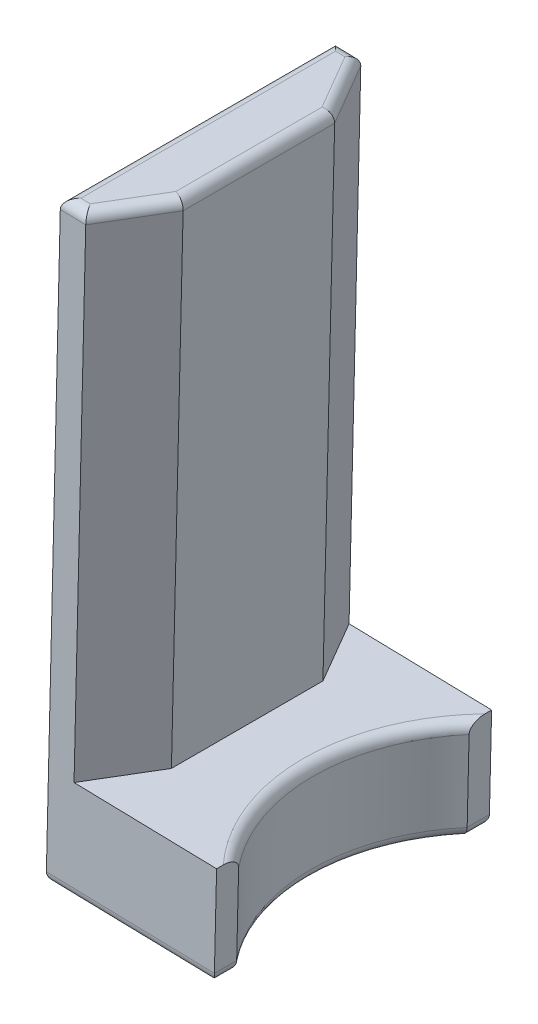
ISO-10303-21;
HEADER;
FILE_DESCRIPTION(('STEP AP214'),'2;1');
FILE_NAME('part.step','',(''),(''),'','','');
FILE_SCHEMA(('AUTOMOTIVE_DESIGN { 1 0 10303 214 1 1 1 1 }'));
ENDSEC;
DATA;
#1=APPLICATION_CONTEXT('core data for automotive mechanical design processes');
#2=APPLICATION_PROTOCOL_DEFINITION('international standard','automotive_design',2000,#1);
#3=PRODUCT_CONTEXT('',#1,'mechanical');
#4=PRODUCT('Part','Part','',(#3));
#5=PRODUCT_RELATED_PRODUCT_CATEGORY('part','',(#4));
#6=PRODUCT_DEFINITION_FORMATION('','',#4);
#7=PRODUCT_DEFINITION_CONTEXT('part definition',#1,'design');
#8=PRODUCT_DEFINITION('design','',#6,#7);
#9=PRODUCT_DEFINITION_SHAPE('','',#8);
#10=(LENGTH_UNIT() NAMED_UNIT(*) SI_UNIT(.MILLI.,.METRE.));
#11=(NAMED_UNIT(*) PLANE_ANGLE_UNIT() SI_UNIT($,.RADIAN.));
#12=(NAMED_UNIT(*) SI_UNIT($,.STERADIAN.) SOLID_ANGLE_UNIT());
#13=UNCERTAINTY_MEASURE_WITH_UNIT(LENGTH_MEASURE(1.E-05),#10,'distance_accuracy_value','');
#14=(GEOMETRIC_REPRESENTATION_CONTEXT(3) GLOBAL_UNCERTAINTY_ASSIGNED_CONTEXT((#13)) GLOBAL_UNIT_ASSIGNED_CONTEXT((#10,
#11,#12)) REPRESENTATION_CONTEXT('',''));
#15=CARTESIAN_POINT('',(0.,0.,0.));
#16=DIRECTION('',(0.,0.,1.));
#17=DIRECTION('',(1.,0.,0.));
#18=AXIS2_PLACEMENT_3D('',#15,#16,#17);
#19=CARTESIAN_POINT('',(312.212710503886,-7.48097473649797,-27.));
#20=DIRECTION('',(-0.999713055263902,0.0239542717466762,0.));
#21=DIRECTION('',(-0.0239542717466762,-0.999713055263902,0.));
#22=AXIS2_PLACEMENT_3D('',#19,#20,#21);
#23=PLANE('',#22);
#24=DIRECTION('',(-0.0239542717466767,-0.999713055263902,0.));
#25=VECTOR('',#24,1.);
#26=CARTESIAN_POINT('',(322.41968800889,418.499358727515,-22.6274169979697));
#27=LINE('',#26,#25);
#28=CARTESIAN_POINT('',(321.557334226009,382.509688738014,-22.6274169979697));
#29=VERTEX_POINT('',#28);
#30=CARTESIAN_POINT('',(321.174065878062,366.514279853791,-22.6274169979697));
#31=VERTEX_POINT('',#30);
#32=EDGE_CURVE('E206',#29,#31,#27,.T.);
#33=ORIENTED_EDGE('',*,*,#32,.T.);
#34=DIRECTION('',(0.,0.,1.));
#35=VECTOR('',#34,1.);
#36=CARTESIAN_POINT('',(321.174065878062,366.514279853791,-27.));
#37=LINE('',#36,#35);
#38=CARTESIAN_POINT('',(321.174065878062,366.514279853792,-27.));
#39=VERTEX_POINT('',#38);
#40=EDGE_CURVE('E194',#31,#39,#37,.F.);
#41=ORIENTED_EDGE('',*,*,#40,.T.);
#42=DIRECTION('',(-0.0239542717466762,-0.999713055263903,0.));
#43=VECTOR('',#42,1.);
#44=CARTESIAN_POINT('',(312.212710503886,-7.48097473649797,-27.));
#45=LINE('',#44,#43);
#46=CARTESIAN_POINT('',(321.605242769503,384.509114848542,-27.));
#47=VERTEX_POINT('',#46);
#48=EDGE_CURVE('E177',#47,#39,#45,.T.);
#49=ORIENTED_EDGE('',*,*,#48,.F.);
#50=DIRECTION('',(0.,0.,1.));
#51=VECTOR('',#50,1.);
#52=CARTESIAN_POINT('',(321.605242769503,384.509114848542,-27.));
#53=LINE('',#52,#51);
#54=CARTESIAN_POINT('',(321.605242769503,384.509114848542,-25.6904651573303));
#55=VERTEX_POINT('',#54);
#56=EDGE_CURVE('E185',#47,#55,#53,.T.);
#57=ORIENTED_EDGE('',*,*,#56,.T.);
#58=CARTESIAN_POINT('',(321.605242769503,384.509114848542,-25.6904651573303));
#59=CARTESIAN_POINT('',(321.605241949484,384.509080625702,-25.5681363487636));
#60=CARTESIAN_POINT('',(321.605119848522,384.503984836229,-25.4458070590447));
#61=CARTESIAN_POINT('',(321.604632711871,384.483654563825,-25.2018334432114));
#62=CARTESIAN_POINT('',(321.604267357184,384.468406767758,-25.0801902283216));
#63=CARTESIAN_POINT('',(321.603288130179,384.42753948401,-24.8373079758295));
#64=CARTESIAN_POINT('',(321.602671640287,384.401810753864,-24.7160871931749));
#65=CARTESIAN_POINT('',(321.601184144398,384.339731260228,-24.4764804771465));
#66=CARTESIAN_POINT('',(321.600313310594,384.303387683096,-24.358092684287));
#67=CARTESIAN_POINT('',(321.59799260216,384.206534706604,-24.089038378026));
#68=CARTESIAN_POINT('',(321.596446876627,384.1420250437,-23.9397805922497));
#69=CARTESIAN_POINT('',(321.592857408088,383.992221342814,-23.6524111430263));
#70=CARTESIAN_POINT('',(321.590815393284,383.906999429977,-23.514262968244));
#71=CARTESIAN_POINT('',(321.586895398504,383.743401471358,-23.2956911996913));
#72=CARTESIAN_POINT('',(321.585164462504,383.671162192501,-23.2106912152554));
#73=CARTESIAN_POINT('',(321.581416254245,383.514733611801,-23.0523514465289));
#74=CARTESIAN_POINT('',(321.5793993065,383.430557853364,-22.978998644326));
#75=CARTESIAN_POINT('',(321.575608188502,383.272338467838,-22.8648632672278));
#76=CARTESIAN_POINT('',(321.573896159977,383.20088827785,-22.8205065344314));
#77=CARTESIAN_POINT('',(321.570325455279,383.051867671368,-22.7439567540167));
#78=CARTESIAN_POINT('',(321.5684672262,382.974315914011,-22.7117282410686));
#79=CARTESIAN_POINT('',(321.565067927367,382.832448799127,-22.6675232461599));
#80=CARTESIAN_POINT('',(321.563548770456,382.769047957193,-22.6526306041589));
#81=CARTESIAN_POINT('',(321.56123883416,382.672644547517,-22.6375804674327));
#82=CARTESIAN_POINT('',(321.560461066946,382.640185032764,-22.6337782023778));
#83=CARTESIAN_POINT('',(321.558900372851,382.575050668465,-22.6286932532046));
#84=CARTESIAN_POINT('',(321.558117443213,382.542375703901,-22.6274120465554));
#85=CARTESIAN_POINT('',(321.557334226009,382.509688738014,-22.6274169979696));
#86=B_SPLINE_CURVE_WITH_KNOTS('',3,(#58,#59,#60,#61,#62,#63,#64,#65,#66,#67,#68,#69,#70,#71,#72,
#73,#74,#75,#76,#77,#78,#79,#80,#81,#82,#83,#84,#85),.UNSPECIFIED.,.F.,.F.,(4,2,2,2,2,2,2,2,2,2,
2,2,2,4),(0.,0.366883681164066,0.734249436281864,1.10554641039437,1.47659259314708,
1.96300563910557,2.44774855162823,2.78149425065146,3.1148642597889,3.36631097381268,
3.61701658608089,3.81170159100011,3.9096853731242,4.00772656166985),.UNSPECIFIED.);
#87=EDGE_CURVE('E270',#55,#29,#86,.T.);
#88=ORIENTED_EDGE('',*,*,#87,.T.);
#89=EDGE_LOOP('',(#33,#41,#49,#57,#88));
#90=FACE_BOUND('',#89,.T.);
#91=ADVANCED_FACE('F49',(#90),#23,.F.);
#92=CARTESIAN_POINT('',(291.218736343345,-6.97793502981761,-27.));
#93=DIRECTION('',(-0.999713055263903,0.0239542717466757,0.));
#94=DIRECTION('',(-0.0239542717466757,-0.999713055263903,0.));
#95=AXIS2_PLACEMENT_3D('',#92,#93,#94);
#96=PLANE('',#95);
#97=DIRECTION('',(0.0239542717466757,0.999713055263903,0.));
#98=VECTOR('',#97,1.);
#99=CARTESIAN_POINT('',(291.218736343345,-6.97793502981761,-14.8756443470179));
#100=LINE('',#99,#98);
#101=CARTESIAN_POINT('',(300.611268608961,385.012154555222,-14.8756443470179));
#102=VERTEX_POINT('',#101);
#103=CARTESIAN_POINT('',(302.910878696641,480.984607860557,-14.8756443470179));
#104=VERTEX_POINT('',#103);
#105=EDGE_CURVE('E222',#102,#104,#100,.T.);
#106=ORIENTED_EDGE('',*,*,#105,.T.);
#107=DIRECTION('',(0.,0.,1.));
#108=VECTOR('',#107,1.);
#109=CARTESIAN_POINT('',(302.910878696641,480.984607860557,-27.));
#110=LINE('',#109,#108);
#111=CARTESIAN_POINT('',(302.910878696641,480.984607860557,14.8756443470179));
#112=VERTEX_POINT('',#111);
#113=EDGE_CURVE('E59',#104,#112,#110,.T.);
#114=ORIENTED_EDGE('',*,*,#113,.T.);
#115=DIRECTION('',(-0.0239542717466757,-0.999713055263903,0.));
#116=VECTOR('',#115,1.);
#117=CARTESIAN_POINT('',(300.611268608961,385.012154555222,14.8756443470179));
#118=LINE('',#117,#116);
#119=CARTESIAN_POINT('',(300.611268608961,385.012154555222,14.8756443470179));
#120=VERTEX_POINT('',#119);
#121=EDGE_CURVE('E212',#112,#120,#118,.T.);
#122=ORIENTED_EDGE('',*,*,#121,.T.);
#123=DIRECTION('',(0.,0.,1.));
#124=VECTOR('',#123,1.);
#125=CARTESIAN_POINT('',(300.611268608961,385.012154555222,-27.));
#126=LINE('',#125,#124);
#127=EDGE_CURVE('E190',#102,#120,#126,.T.);
#128=ORIENTED_EDGE('',*,*,#127,.F.);
#129=EDGE_LOOP('',(#106,#114,#122,#128));
#130=FACE_BOUND('',#129,.T.);
#131=ADVANCED_FACE('F370',(#130),#96,.F.);
#132=CARTESIAN_POINT('',(9.39253226561721,391.99008958504,-27.));
#133=DIRECTION('',(-0.0239542717466786,-0.999713055263902,0.));
#134=DIRECTION('',(0.999713055263903,-0.0239542717466787,0.));
#135=AXIS2_PLACEMENT_3D('',#132,#133,#134);
#136=PLANE('',#135);
#137=CARTESIAN_POINT('',(321.605242769503,384.509114848542,25.6904651573303));
#138=VERTEX_POINT('',#137);
#139=CARTESIAN_POINT('',(321.605242769503,384.509114848542,27.));
#140=VERTEX_POINT('',#139);
#141=EDGE_CURVE('E182',#138,#140,#53,.T.);
#142=ORIENTED_EDGE('',*,*,#141,.F.);
#143=CARTESIAN_POINT('',(349.597208316892,383.838395239635,0.));
#144=DIRECTION('',(-0.0239542717466786,-0.999713055263902,0.));
#145=DIRECTION('',(0.999713055263903,-0.0239542717466787,0.));
#146=AXIS2_PLACEMENT_3D('',#143,#144,#145);
#147=CIRCLE('',#146,38.);
#148=EDGE_CURVE('E13',#138,#55,#147,.T.);
#149=ORIENTED_EDGE('',*,*,#148,.T.);
#150=ORIENTED_EDGE('',*,*,#56,.F.);
#151=DIRECTION('',(0.999713055263902,-0.0239542717466787,0.));
#152=VECTOR('',#151,1.);
#153=CARTESIAN_POINT('',(9.39253226561721,391.99008958504,-27.));
#154=LINE('',#153,#152);
#155=CARTESIAN_POINT('',(293.613277222113,385.179834457449,-27.));
#156=VERTEX_POINT('',#155);
#157=EDGE_CURVE('E172',#156,#47,#154,.T.);
#158=ORIENTED_EDGE('',*,*,#157,.F.);
#159=DIRECTION('',(-0.49985652763195,0.0119771358733393,-0.866025403784439));
#160=VECTOR('',#159,1.);
#161=CARTESIAN_POINT('',(222.55809098299,386.882398239347,-150.1065174746));
#162=LINE('',#161,#160);
#163=EDGE_CURVE('E224',#156,#102,#162,.F.);
#164=ORIENTED_EDGE('',*,*,#163,.T.);
#165=ORIENTED_EDGE('',*,*,#127,.T.);
#166=DIRECTION('',(-0.49985652763195,0.0119771358733393,0.866025403784439));
#167=VECTOR('',#166,1.);
#168=CARTESIAN_POINT('',(245.934067346534,386.322283027079,109.6065174746));
#169=LINE('',#168,#167);
#170=CARTESIAN_POINT('',(293.613277222113,385.179834457449,27.));
#171=VERTEX_POINT('',#170);
#172=EDGE_CURVE('E218',#120,#171,#169,.T.);
#173=ORIENTED_EDGE('',*,*,#172,.T.);
#174=DIRECTION('',(0.999713055263902,-0.0239542717466787,0.));
#175=VECTOR('',#174,1.);
#176=CARTESIAN_POINT('',(9.39253226561721,391.99008958504,27.));
#177=LINE('',#176,#175);
#178=EDGE_CURVE('E198',#171,#140,#177,.T.);
#179=ORIENTED_EDGE('',*,*,#178,.T.);
#180=EDGE_LOOP('',(#142,#149,#150,#158,#164,#165,#173,#179));
#181=FACE_BOUND('',#180,.T.);
#182=ADVANCED_FACE('F187',(#181),#136,.F.);
#183=DIRECTION('',(-0.0239542717466762,-0.999713055263903,0.));
#184=VECTOR('',#183,1.);
#185=CARTESIAN_POINT('',(312.212710503886,-7.48097473649797,27.));
#186=LINE('',#185,#184);
#187=CARTESIAN_POINT('',(321.174065878062,366.514279853792,27.));
#188=VERTEX_POINT('',#187);
#189=EDGE_CURVE('E205',#140,#188,#186,.T.);
#190=ORIENTED_EDGE('',*,*,#189,.T.);
#191=DIRECTION('',(0.,0.,1.));
#192=VECTOR('',#191,1.);
#193=CARTESIAN_POINT('',(321.174065878062,366.514279853791,-27.));
#194=LINE('',#193,#192);
#195=CARTESIAN_POINT('',(321.174065878062,366.514279853791,22.6274169979697));
#196=VERTEX_POINT('',#195);
#197=EDGE_CURVE('E257',#188,#196,#194,.F.);
#198=ORIENTED_EDGE('',*,*,#197,.T.);
#199=DIRECTION('',(-0.0239542717466767,-0.999713055263902,0.));
#200=VECTOR('',#199,1.);
#201=CARTESIAN_POINT('',(322.41968800889,418.499358727515,22.6274169979697));
#202=LINE('',#201,#200);
#203=CARTESIAN_POINT('',(321.557334226009,382.509688738014,22.6274169979697));
#204=VERTEX_POINT('',#203);
#205=EDGE_CURVE('E331',#196,#204,#202,.F.);
#206=ORIENTED_EDGE('',*,*,#205,.T.);
#207=CARTESIAN_POINT('',(321.557334226009,382.509688738014,22.6274169979697));
#208=CARTESIAN_POINT('',(321.558349043023,382.552041343337,22.6273963115066));
#209=CARTESIAN_POINT('',(321.559363569912,382.594381840561,22.6295578236394));
#210=CARTESIAN_POINT('',(321.561381268919,382.678588952354,22.638084791592));
#211=CARTESIAN_POINT('',(321.56238445304,382.72045606787,22.6444452756434));
#212=CARTESIAN_POINT('',(321.564360013763,382.802904570888,22.6611165661752));
#213=CARTESIAN_POINT('',(321.565332609545,382.843495105653,22.6713823438869));
#214=CARTESIAN_POINT('',(321.567251022036,382.923558571316,22.6955954322174));
#215=CARTESIAN_POINT('',(321.568196832478,382.963031240577,22.7095435969424));
#216=CARTESIAN_POINT('',(321.570975899409,383.079013455444,22.7563049474158));
#217=CARTESIAN_POINT('',(321.572761731381,383.153543775359,22.7941327206024));
#218=CARTESIAN_POINT('',(321.576179650814,383.296188006637,22.8805674638298));
#219=CARTESIAN_POINT('',(321.577811243926,383.36428128672,22.9292075229161));
#220=CARTESIAN_POINT('',(321.581735809102,383.528069987293,23.0629049059267));
#221=CARTESIAN_POINT('',(321.583918968133,383.619182445551,23.1535715282995));
#222=CARTESIAN_POINT('',(321.5879205667,383.786186075308,23.3479488072635));
#223=CARTESIAN_POINT('',(321.589738192008,383.862043265571,23.4516877651429));
#224=CARTESIAN_POINT('',(321.592633917385,383.98289413072,23.6414504412009));
#225=CARTESIAN_POINT('',(321.593784122599,384.030897058147,23.7255928215025));
#226=CARTESIAN_POINT('',(321.595906340055,384.119466166789,23.8977207080181));
#227=CARTESIAN_POINT('',(321.596878259815,384.160028488336,23.9857081796607));
#228=CARTESIAN_POINT('',(321.599544885277,384.271318045208,24.2543090077469));
#229=CARTESIAN_POINT('',(321.600987949932,384.331543235514,24.4393895430891));
#230=CARTESIAN_POINT('',(321.602642135138,384.400579379226,24.7146008693631));
#231=CARTESIAN_POINT('',(321.603098778784,384.419637049576,24.8023822533798));
#232=CARTESIAN_POINT('',(321.603880754416,384.452272199435,24.9789863881972));
#233=CARTESIAN_POINT('',(321.604206086206,384.465849670758,25.0678091405532));
#234=CARTESIAN_POINT('',(321.604724480375,384.487484451551,25.2454495296736));
#235=CARTESIAN_POINT('',(321.604918502969,384.495581834868,25.3342623481964));
#236=CARTESIAN_POINT('',(321.605177522037,384.506391795895,25.5122035168088));
#237=CARTESIAN_POINT('',(321.605242535455,384.509105080725,25.6013318239231));
#238=CARTESIAN_POINT('',(321.605242769503,384.509114848542,25.6904651573303));
#239=B_SPLINE_CURVE_WITH_KNOTS('',3,(#207,#208,#209,#210,#211,#212,#213,#214,#215,#216,#217,
#218,#219,#220,#221,#222,#223,#224,#225,#226,#227,#228,#229,#230,#231,#232,#233,#234,#235,#236,
#237,#238),.UNSPECIFIED.,.F.,.F.,(4,2,2,2,2,2,2,2,2,2,2,2,2,2,2,4),(0.,0.127019638181601,
0.253889148597094,0.379338114229379,0.504816202551647,0.754391049089529,1.00474045481316,
1.38824932833235,1.7726032327971,2.06285266272697,2.3532522306536,2.9346466818837,
3.20402320062749,3.47340012174984,3.74078526650697,4.00813529193139),.UNSPECIFIED.);
#240=EDGE_CURVE('E251',#204,#138,#239,.T.);
#241=ORIENTED_EDGE('',*,*,#240,.T.);
#242=ORIENTED_EDGE('',*,*,#141,.T.);
#243=EDGE_LOOP('',(#190,#198,#206,#241,#242));
#244=FACE_BOUND('',#243,.T.);
#245=ADVANCED_FACE('F259',(#244),#23,.F.);
#246=CARTESIAN_POINT('',(8.91344683068291,371.995828479762,-27.));
#247=DIRECTION('',(0.0239542717466767,0.999713055263902,0.));
#248=DIRECTION('',(-0.999713055263903,0.0239542717466767,0.));
#249=AXIS2_PLACEMENT_3D('',#246,#247,#248);
#250=PLANE('',#249);
#251=DIRECTION('',(0.,0.,1.));
#252=VECTOR('',#251,1.);
#253=CARTESIAN_POINT('',(290.135052621388,365.257436167411,-27.));
#254=LINE('',#253,#252);
#255=CARTESIAN_POINT('',(290.135052621388,365.257436167411,25.));
#256=VERTEX_POINT('',#255);
#257=CARTESIAN_POINT('',(290.135052621388,365.257436167411,-25.));
#258=VERTEX_POINT('',#257);
#259=EDGE_CURVE('E238',#256,#258,#254,.F.);
#260=ORIENTED_EDGE('',*,*,#259,.T.);
#261=DIRECTION('',(-0.999713055263903,0.0239542717466767,0.));
#262=VECTOR('',#261,1.);
#263=CARTESIAN_POINT('',(8.91344683068291,371.995828479762,-25.));
#264=LINE('',#263,#262);
#265=CARTESIAN_POINT('',(319.126731224041,364.562762286757,-25.));
#266=VERTEX_POINT('',#265);
#267=EDGE_CURVE('E240',#258,#266,#264,.F.);
#268=ORIENTED_EDGE('',*,*,#267,.T.);
#269=DIRECTION('',(0.,0.,1.));
#270=VECTOR('',#269,1.);
#271=CARTESIAN_POINT('',(319.126731224041,364.562762286757,-27.));
#272=LINE('',#271,#270);
#273=CARTESIAN_POINT('',(319.126731224041,364.562762286757,-23.3238075793814));
#274=VERTEX_POINT('',#273);
#275=EDGE_CURVE('E230',#266,#274,#272,.T.);
#276=ORIENTED_EDGE('',*,*,#275,.T.);
#277=CARTESIAN_POINT('',(349.118122881958,363.844134134357,0.));
#278=DIRECTION('',(0.0239542717466767,0.999713055263902,0.));
#279=DIRECTION('',(-0.999713055263903,0.0239542717466767,0.));
#280=AXIS2_PLACEMENT_3D('',#277,#278,#279);
#281=CIRCLE('',#280,38.);
#282=CARTESIAN_POINT('',(319.126731224041,364.562762286757,23.3238075793814));
#283=VERTEX_POINT('',#282);
#284=EDGE_CURVE('E232',#274,#283,#281,.T.);
#285=ORIENTED_EDGE('',*,*,#284,.T.);
#286=DIRECTION('',(0.,0.,1.));
#287=VECTOR('',#286,1.);
#288=CARTESIAN_POINT('',(319.126731224041,364.562762286757,-27.));
#289=LINE('',#288,#287);
#290=CARTESIAN_POINT('',(319.126731224041,364.562762286757,25.));
#291=VERTEX_POINT('',#290);
#292=EDGE_CURVE('E234',#283,#291,#289,.T.);
#293=ORIENTED_EDGE('',*,*,#292,.T.);
#294=DIRECTION('',(-0.999713055263903,0.0239542717466767,0.));
#295=VECTOR('',#294,1.);
#296=CARTESIAN_POINT('',(288.13562651086,365.305344710904,25.));
#297=LINE('',#296,#295);
#298=EDGE_CURVE('E236',#291,#256,#297,.T.);
#299=ORIENTED_EDGE('',*,*,#298,.T.);
#300=EDGE_LOOP('',(#260,#268,#276,#285,#293,#299));
#301=FACE_BOUND('',#300,.T.);
#302=ADVANCED_FACE('F264',(#301),#250,.F.);
#303=CARTESIAN_POINT('',(279.222179680178,-6.69048376885749,-27.));
#304=DIRECTION('',(0.999713055263903,-0.0239542717466757,0.));
#305=DIRECTION('',(0.0239542717466757,0.999713055263903,0.));
#306=AXIS2_PLACEMENT_3D('',#303,#304,#305);
#307=PLANE('',#306);
#308=DIRECTION('',(0.0239542717466757,0.999713055263902,0.));
#309=VECTOR('',#308,1.);
#310=CARTESIAN_POINT('',(279.222179680178,-6.69048376885749,-27.));
#311=LINE('',#310,#309);
#312=CARTESIAN_POINT('',(288.183535054354,367.304770821432,-27.));
#313=VERTEX_POINT('',#312);
#314=CARTESIAN_POINT('',(290.914322033475,481.272059121517,-27.));
#315=VERTEX_POINT('',#314);
#316=EDGE_CURVE('E195',#313,#315,#311,.T.);
#317=ORIENTED_EDGE('',*,*,#316,.F.);
#318=DIRECTION('',(0.,0.,1.));
#319=VECTOR('',#318,1.);
#320=CARTESIAN_POINT('',(288.183535054354,367.304770821432,-27.));
#321=LINE('',#320,#319);
#322=CARTESIAN_POINT('',(288.183535054354,367.304770821432,27.));
#323=VERTEX_POINT('',#322);
#324=EDGE_CURVE('E245',#313,#323,#321,.T.);
#325=ORIENTED_EDGE('',*,*,#324,.T.);
#326=DIRECTION('',(0.0239542717466757,0.999713055263902,0.));
#327=VECTOR('',#326,1.);
#328=CARTESIAN_POINT('',(279.222179680178,-6.69048376885749,27.));
#329=LINE('',#328,#327);
#330=CARTESIAN_POINT('',(290.914322033475,481.272059121517,27.));
#331=VERTEX_POINT('',#330);
#332=EDGE_CURVE('E202',#323,#331,#329,.T.);
#333=ORIENTED_EDGE('',*,*,#332,.T.);
#334=DIRECTION('',(0.,0.,1.));
#335=VECTOR('',#334,1.);
#336=CARTESIAN_POINT('',(290.914322033475,481.272059121517,-27.));
#337=LINE('',#336,#335);
#338=EDGE_CURVE('E243',#331,#315,#337,.F.);
#339=ORIENTED_EDGE('',*,*,#338,.T.);
#340=EDGE_LOOP('',(#317,#325,#333,#339));
#341=FACE_BOUND('',#340,.T.);
#342=ADVANCED_FACE('F424',(#341),#307,.F.);
#343=CARTESIAN_POINT('',(11.7400508967914,489.961969000903,-27.));
#344=DIRECTION('',(-0.023954271746678,-0.999713055263902,0.));
#345=DIRECTION('',(0.999713055263903,-0.023954271746678,0.));
#346=AXIS2_PLACEMENT_3D('',#343,#344,#345);
#347=PLANE('',#346);
#348=DIRECTION('',(0.999713055263903,-0.023954271746678,0.));
#349=VECTOR('',#348,1.);
#350=CARTESIAN_POINT('',(295.960795853288,483.151713873311,25.));
#351=LINE('',#350,#349);
#352=CARTESIAN_POINT('',(292.961656687496,483.223576688551,25.));
#353=VERTEX_POINT('',#352);
#354=CARTESIAN_POINT('',(294.80642665015,483.179373883793,25.));
#355=VERTEX_POINT('',#354);
#356=EDGE_CURVE('E286',#353,#355,#351,.T.);
#357=ORIENTED_EDGE('',*,*,#356,.T.);
#358=DIRECTION('',(0.49985652763195,-0.011977135873339,-0.866025403784439));
#359=VECTOR('',#358,1.);
#360=CARTESIAN_POINT('',(301.227233435428,483.025523986808,13.8756443470179));
#361=LINE('',#360,#359);
#362=CARTESIAN_POINT('',(300.959361129607,483.031942514578,14.3397459621556));
#363=VERTEX_POINT('',#362);
#364=EDGE_CURVE('E288',#355,#363,#361,.T.);
#365=ORIENTED_EDGE('',*,*,#364,.T.);
#366=DIRECTION('',(0.,0.,1.));
#367=VECTOR('',#366,1.);
#368=CARTESIAN_POINT('',(300.959361129607,483.031942514578,-27.));
#369=LINE('',#368,#367);
#370=CARTESIAN_POINT('',(300.959361129607,483.031942514578,-14.3397459621557));
#371=VERTEX_POINT('',#370);
#372=EDGE_CURVE('E278',#363,#371,#369,.F.);
#373=ORIENTED_EDGE('',*,*,#372,.T.);
#374=DIRECTION('',(0.49985652763195,-0.011977135873339,0.866025403784439));
#375=VECTOR('',#374,1.);
#376=CARTESIAN_POINT('',(294.229242048581,483.193203889035,-26.));
#377=LINE('',#376,#375);
#378=CARTESIAN_POINT('',(294.80642665015,483.179373883793,-25.));
#379=VERTEX_POINT('',#378);
#380=EDGE_CURVE('E280',#371,#379,#377,.F.);
#381=ORIENTED_EDGE('',*,*,#380,.T.);
#382=DIRECTION('',(0.999713055263903,-0.023954271746678,0.));
#383=VECTOR('',#382,1.);
#384=CARTESIAN_POINT('',(11.7400508967914,489.961969000903,-25.));
#385=LINE('',#384,#383);
#386=CARTESIAN_POINT('',(292.961656687496,483.223576688551,-25.));
#387=VERTEX_POINT('',#386);
#388=EDGE_CURVE('E282',#379,#387,#385,.F.);
#389=ORIENTED_EDGE('',*,*,#388,.T.);
#390=DIRECTION('',(0.,0.,1.));
#391=VECTOR('',#390,1.);
#392=CARTESIAN_POINT('',(292.961656687496,483.223576688551,-27.));
#393=LINE('',#392,#391);
#394=EDGE_CURVE('E284',#387,#353,#393,.T.);
#395=ORIENTED_EDGE('',*,*,#394,.T.);
#396=EDGE_LOOP('',(#357,#365,#373,#381,#389,#395));
#397=FACE_BOUND('',#396,.T.);
#398=ADVANCED_FACE('F380',(#397),#347,.F.);
#399=CARTESIAN_POINT('',(0.,0.,-27.));
#400=DIRECTION('',(0.,0.,1.));
#401=DIRECTION('',(1.,0.,0.));
#402=AXIS2_PLACEMENT_3D('',#399,#400,#401);
#403=PLANE('',#402);
#404=ORIENTED_EDGE('',*,*,#48,.T.);
#405=DIRECTION('',(-0.999713055263903,0.0239542717466767,0.));
#406=VECTOR('',#405,1.);
#407=CARTESIAN_POINT('',(8.96135537417627,373.99525459029,-27.));
#408=LINE('',#407,#406);
#409=EDGE_CURVE('E228',#39,#313,#408,.T.);
#410=ORIENTED_EDGE('',*,*,#409,.T.);
#411=ORIENTED_EDGE('',*,*,#316,.T.);
#412=DIRECTION('',(0.999713055263903,-0.023954271746678,0.));
#413=VECTOR('',#412,1.);
#414=CARTESIAN_POINT('',(11.692142353298,487.962542890375,-27.));
#415=LINE('',#414,#413);
#416=CARTESIAN_POINT('',(295.912887309794,481.152287762783,-27.));
#417=VERTEX_POINT('',#416);
#418=EDGE_CURVE('E226',#315,#417,#415,.T.);
#419=ORIENTED_EDGE('',*,*,#418,.T.);
#420=DIRECTION('',(-0.0239542717466757,-0.999713055263903,0.));
#421=VECTOR('',#420,1.);
#422=CARTESIAN_POINT('',(284.220744956497,-6.81025512759088,-27.));
#423=LINE('',#422,#421);
#424=EDGE_CURVE('E179',#417,#156,#423,.T.);
#425=ORIENTED_EDGE('',*,*,#424,.T.);
#426=ORIENTED_EDGE('',*,*,#157,.T.);
#427=EDGE_LOOP('',(#404,#410,#411,#419,#425,#426));
#428=FACE_BOUND('',#427,.T.);
#429=ADVANCED_FACE('F174',(#428),#403,.F.);
#430=CARTESIAN_POINT('',(0.,0.,27.));
#431=DIRECTION('',(0.,0.,1.));
#432=DIRECTION('',(1.,0.,0.));
#433=AXIS2_PLACEMENT_3D('',#430,#431,#432);
#434=PLANE('',#433);
#435=ORIENTED_EDGE('',*,*,#332,.F.);
#436=DIRECTION('',(-0.999713055263903,0.0239542717466767,0.));
#437=VECTOR('',#436,1.);
#438=CARTESIAN_POINT('',(321.174065878062,366.514279853791,27.));
#439=LINE('',#438,#437);
#440=EDGE_CURVE('E249',#323,#188,#439,.F.);
#441=ORIENTED_EDGE('',*,*,#440,.T.);
#442=ORIENTED_EDGE('',*,*,#189,.F.);
#443=ORIENTED_EDGE('',*,*,#178,.F.);
#444=DIRECTION('',(0.0239542717466757,0.999713055263903,0.));
#445=VECTOR('',#444,1.);
#446=CARTESIAN_POINT('',(295.960795853288,483.151713873311,27.));
#447=LINE('',#446,#445);
#448=CARTESIAN_POINT('',(295.912887309794,481.152287762783,27.));
#449=VERTEX_POINT('',#448);
#450=EDGE_CURVE('E215',#171,#449,#447,.T.);
#451=ORIENTED_EDGE('',*,*,#450,.T.);
#452=DIRECTION('',(0.999713055263903,-0.023954271746678,0.));
#453=VECTOR('',#452,1.);
#454=CARTESIAN_POINT('',(290.914322033475,481.272059121517,27.));
#455=LINE('',#454,#453);
#456=EDGE_CURVE('E247',#449,#331,#455,.F.);
#457=ORIENTED_EDGE('',*,*,#456,.T.);
#458=EDGE_LOOP('',(#435,#441,#442,#443,#451,#457));
#459=FACE_BOUND('',#458,.T.);
#460=ADVANCED_FACE('F405',(#459),#434,.T.);
#461=CARTESIAN_POINT('',(350.411653556279,417.828639118608,0.));
#462=DIRECTION('',(-0.0239542717466767,-0.999713055263902,0.));
#463=DIRECTION('',(0.999713055263902,-0.0239542717466767,0.));
#464=AXIS2_PLACEMENT_3D('',#461,#462,#463);
#465=CYLINDRICAL_SURFACE('',#464,36.);
#466=ORIENTED_EDGE('',*,*,#205,.F.);
#467=CARTESIAN_POINT('',(349.166031425452,365.843560244884,0.));
#468=DIRECTION('',(0.0239542717466767,0.999713055263902,0.));
#469=DIRECTION('',(-0.999713055263903,0.0239542717466767,0.));
#470=AXIS2_PLACEMENT_3D('',#467,#468,#469);
#471=CIRCLE('',#470,36.);
#472=EDGE_CURVE('E276',#196,#31,#471,.F.);
#473=ORIENTED_EDGE('',*,*,#472,.T.);
#474=ORIENTED_EDGE('',*,*,#32,.F.);
#475=CARTESIAN_POINT('',(349.549299773398,381.838969129107,0.));
#476=DIRECTION('',(-0.0239542717466786,-0.999713055263902,0.));
#477=DIRECTION('',(0.999713055263903,-0.0239542717466787,0.));
#478=AXIS2_PLACEMENT_3D('',#475,#476,#477);
#479=CIRCLE('',#478,36.);
#480=EDGE_CURVE('E412',#29,#204,#479,.F.);
#481=ORIENTED_EDGE('',*,*,#480,.T.);
#482=EDGE_LOOP('',(#466,#473,#474,#481));
#483=FACE_BOUND('',#482,.T.);
#484=ADVANCED_FACE('F384',(#483),#465,.F.);
#485=CARTESIAN_POINT('',(291.218736343345,-6.97793502981761,14.8756443470179));
#486=DIRECTION('',(0.865776902353497,-0.020745007861777,0.499999999999999));
#487=DIRECTION('',(0.0239542717466757,0.999713055263903,0.));
#488=AXIS2_PLACEMENT_3D('',#485,#486,#487);
#489=PLANE('',#488);
#490=ORIENTED_EDGE('',*,*,#121,.F.);
#491=DIRECTION('',(0.49985652763195,-0.011977135873339,-0.86602540378444));
#492=VECTOR('',#491,1.);
#493=CARTESIAN_POINT('',(295.912887309794,481.152287762783,27.));
#494=LINE('',#493,#492);
#495=EDGE_CURVE('E291',#112,#449,#494,.F.);
#496=ORIENTED_EDGE('',*,*,#495,.T.);
#497=ORIENTED_EDGE('',*,*,#450,.F.);
#498=ORIENTED_EDGE('',*,*,#172,.F.);
#499=EDGE_LOOP('',(#490,#496,#497,#498));
#500=FACE_BOUND('',#499,.T.);
#501=ADVANCED_FACE('F381',(#500),#489,.T.);
#502=CARTESIAN_POINT('',(284.220744956497,-6.81025512759088,-27.));
#503=DIRECTION('',(-0.865776902353497,0.020745007861777,0.499999999999999));
#504=DIRECTION('',(-0.0239542717466757,-0.999713055263903,0.));
#505=AXIS2_PLACEMENT_3D('',#502,#503,#504);
#506=PLANE('',#505);
#507=ORIENTED_EDGE('',*,*,#424,.F.);
#508=DIRECTION('',(-0.49985652763195,0.011977135873339,-0.86602540378444));
#509=VECTOR('',#508,1.);
#510=CARTESIAN_POINT('',(302.910878696641,480.984607860557,-14.8756443470179));
#511=LINE('',#510,#509);
#512=EDGE_CURVE('E67',#417,#104,#511,.F.);
#513=ORIENTED_EDGE('',*,*,#512,.T.);
#514=ORIENTED_EDGE('',*,*,#105,.F.);
#515=ORIENTED_EDGE('',*,*,#163,.F.);
#516=EDGE_LOOP('',(#507,#513,#514,#515));
#517=FACE_BOUND('',#516,.T.);
#518=ADVANCED_FACE('F337',(#517),#506,.F.);
#519=CARTESIAN_POINT('',(319.174639767535,366.562188397285,-27.));
#520=DIRECTION('',(0.,0.,1.));
#521=DIRECTION('',(1.,0.,0.));
#522=AXIS2_PLACEMENT_3D('',#519,#520,#521);
#523=CYLINDRICAL_SURFACE('',#522,2.);
#524=CARTESIAN_POINT('',(319.174639767535,366.562188397285,25.));
#525=DIRECTION('',(-0.706903880617827,0.0169382279904604,0.707106781186547));
#526=DIRECTION('',(0.706903880617827,-0.0169382279904604,0.707106781186547));
#527=AXIS2_PLACEMENT_3D('',#524,#525,#526);
#528=ELLIPSE('',#527,2.82842712474619,2.);
#529=EDGE_CURVE('E311',#291,#188,#528,.T.);
#530=ORIENTED_EDGE('',*,*,#529,.F.);
#531=ORIENTED_EDGE('',*,*,#292,.F.);
#532=CARTESIAN_POINT('',(321.174065878062,366.514279853791,22.6274169979697));
#533=CARTESIAN_POINT('',(321.172780555362,366.460346634354,22.6274143660936));
#534=CARTESIAN_POINT('',(321.169299280151,366.406469633514,22.6281886995641));
#535=CARTESIAN_POINT('',(321.158007980469,366.299224205555,22.6312711304568));
#536=CARTESIAN_POINT('',(321.150198679209,366.245855694981,22.633578971643));
#537=CARTESIAN_POINT('',(321.1303366728,366.140125734529,22.6397012787027));
#538=CARTESIAN_POINT('',(321.118293679849,366.087762266584,22.6435122986653));
#539=CARTESIAN_POINT('',(321.090084212557,365.984302849586,22.6525984856299));
#540=CARTESIAN_POINT('',(321.073917693095,365.933206914412,22.6578736686535));
#541=CARTESIAN_POINT('',(321.019436541857,365.782365497892,22.6758237973781));
#542=CARTESIAN_POINT('',(320.975119962058,365.68495926187,22.6906296182942));
#543=CARTESIAN_POINT('',(320.872075020727,365.499163030593,22.7253537807235));
#544=CARTESIAN_POINT('',(320.813343159989,365.410775231883,22.745273363619));
#545=CARTESIAN_POINT('',(320.681750712942,365.243002769582,22.7900867686219));
#546=CARTESIAN_POINT('',(320.608580520252,365.163890206535,22.8150900431716));
#547=CARTESIAN_POINT('',(320.451307606168,365.018956192013,22.868940246652));
#548=CARTESIAN_POINT('',(320.367201258253,364.95313916802,22.8977884506736));
#549=CARTESIAN_POINT('',(320.185607605639,364.832901010953,22.9601262406552));
#550=CARTESIAN_POINT('',(320.087642750437,364.779288182721,22.9937824225858));
#551=CARTESIAN_POINT('',(319.884879356661,364.689259902545,23.0634517086957));
#552=CARTESIAN_POINT('',(319.780080255446,364.652845868556,23.0994650069289));
#553=CARTESIAN_POINT('',(319.585657065701,364.602784336995,23.1662586983233));
#554=CARTESIAN_POINT('',(319.496688668803,364.586222241528,23.1968170280274));
#555=CARTESIAN_POINT('',(319.31758807642,364.565274278379,23.2583118651315));
#556=CARTESIAN_POINT('',(319.227458544307,364.560864284775,23.2892475005608));
#557=CARTESIAN_POINT('',(319.13392857976,364.56259952706,23.3213381805012));
#558=CARTESIAN_POINT('',(319.130329714937,364.562676038063,23.322572953468));
#559=CARTESIAN_POINT('',(319.126731224041,364.562762286757,23.3238075793814));
#560=B_SPLINE_CURVE_WITH_KNOTS('',3,(#532,#533,#534,#535,#536,#537,#538,#539,#540,#541,#542,
#543,#544,#545,#546,#547,#548,#549,#550,#551,#552,#553,#554,#555,#556,#557,#558,#559),
.UNSPECIFIED.,.F.,.F.,(4,2,2,2,2,2,2,2,2,2,2,2,2,4),(0.,0.161789410550867,0.323551794289331,
0.484945486740245,0.646340945311215,0.968808274461575,1.29135395774169,1.6217649469433,
1.9522857839924,2.30067268140314,2.6490882965743,2.93491750050794,3.2201788291758,
3.23159547381293),.UNSPECIFIED.);
#561=EDGE_CURVE('E325',#196,#283,#560,.T.);
#562=ORIENTED_EDGE('',*,*,#561,.F.);
#563=ORIENTED_EDGE('',*,*,#197,.F.);
#564=EDGE_LOOP('',(#530,#531,#562,#563));
#565=FACE_BOUND('',#564,.T.);
#566=ADVANCED_FACE('F321',(#565),#523,.T.);
#567=CARTESIAN_POINT('',(349.166031425452,365.843560244884,0.));
#568=DIRECTION('',(0.0239542717466767,0.999713055263902,0.));
#569=DIRECTION('',(-0.999713055263903,0.0239542717466767,0.));
#570=AXIS2_PLACEMENT_3D('',#567,#568,#569);
#571=TOROIDAL_SURFACE('',#570,38.,2.);
#572=ORIENTED_EDGE('',*,*,#561,.T.);
#573=ORIENTED_EDGE('',*,*,#284,.F.);
#574=CARTESIAN_POINT('',(321.174065878062,366.514279853791,-22.6274169979697));
#575=CARTESIAN_POINT('',(321.172780555362,366.460346634354,-22.6274143660936));
#576=CARTESIAN_POINT('',(321.169299280151,366.406469633514,-22.6281886995641));
#577=CARTESIAN_POINT('',(321.158007980469,366.299224205555,-22.6312711304568));
#578=CARTESIAN_POINT('',(321.150198679209,366.245855694981,-22.6335789716431));
#579=CARTESIAN_POINT('',(321.1303366728,366.140125734529,-22.6397012787026));
#580=CARTESIAN_POINT('',(321.118293679849,366.087762266584,-22.6435122986653));
#581=CARTESIAN_POINT('',(321.090084212557,365.984302849586,-22.6525984856299));
#582=CARTESIAN_POINT('',(321.073917693095,365.933206914412,-22.6578736686535));
#583=CARTESIAN_POINT('',(321.019436541857,365.782365497892,-22.6758237973781));
#584=CARTESIAN_POINT('',(320.975119962058,365.68495926187,-22.6906296182942));
#585=CARTESIAN_POINT('',(320.872075020727,365.499163030593,-22.7253537807235));
#586=CARTESIAN_POINT('',(320.813343159989,365.410775231883,-22.745273363619));
#587=CARTESIAN_POINT('',(320.681750712942,365.243002769582,-22.7900867686219));
#588=CARTESIAN_POINT('',(320.608580520252,365.163890206535,-22.8150900431716));
#589=CARTESIAN_POINT('',(320.451307606168,365.018956192013,-22.868940246652));
#590=CARTESIAN_POINT('',(320.367201258253,364.95313916802,-22.8977884506736));
#591=CARTESIAN_POINT('',(320.185607605639,364.832901010953,-22.9601262406552));
#592=CARTESIAN_POINT('',(320.087642750437,364.779288182721,-22.9937824225858));
#593=CARTESIAN_POINT('',(319.884879356661,364.689259902545,-23.0634517086957));
#594=CARTESIAN_POINT('',(319.780080255446,364.652845868556,-23.0994650069289));
#595=CARTESIAN_POINT('',(319.585657065701,364.602784336995,-23.1662586983233));
#596=CARTESIAN_POINT('',(319.496688668803,364.586222241528,-23.1968170280274));
#597=CARTESIAN_POINT('',(319.31758807642,364.565274278379,-23.2583118651315));
#598=CARTESIAN_POINT('',(319.227458544307,364.560864284775,-23.2892475005608));
#599=CARTESIAN_POINT('',(319.13392857976,364.56259952706,-23.3213381805012));
#600=CARTESIAN_POINT('',(319.130329714937,364.562676038063,-23.322572953468));
#601=CARTESIAN_POINT('',(319.126731224041,364.562762286757,-23.3238075793814));
#602=B_SPLINE_CURVE_WITH_KNOTS('',3,(#574,#575,#576,#577,#578,#579,#580,#581,#582,#583,#584,
#585,#586,#587,#588,#589,#590,#591,#592,#593,#594,#595,#596,#597,#598,#599,#600,#601),
.UNSPECIFIED.,.F.,.F.,(4,2,2,2,2,2,2,2,2,2,2,2,2,4),(0.,0.161789410550867,0.323551794289331,
0.484945486740244,0.646340945311215,0.968808274461576,1.29135395774169,1.6217649469433,
1.9522857839924,2.30067268140314,2.6490882965743,2.934917500508,3.2201788291758,
3.23159547381293),.UNSPECIFIED.);
#603=EDGE_CURVE('E303',#31,#274,#602,.T.);
#604=ORIENTED_EDGE('',*,*,#603,.F.);
#605=ORIENTED_EDGE('',*,*,#472,.F.);
#606=EDGE_LOOP('',(#572,#573,#604,#605));
#607=FACE_BOUND('',#606,.T.);
#608=ADVANCED_FACE('F316',(#607),#571,.T.);
#609=CARTESIAN_POINT('',(8.96135537417626,373.99525459029,25.));
#610=DIRECTION('',(0.999713055263903,-0.0239542717466767,0.));
#611=DIRECTION('',(0.0239542717466767,0.999713055263903,0.));
#612=AXIS2_PLACEMENT_3D('',#609,#610,#611);
#613=CYLINDRICAL_SURFACE('',#612,2.);
#614=ORIENTED_EDGE('',*,*,#529,.T.);
#615=ORIENTED_EDGE('',*,*,#440,.F.);
#616=CARTESIAN_POINT('',(290.182961164881,367.256862277938,25.));
#617=DIRECTION('',(0.706903880617827,-0.0169382279904604,0.707106781186547));
#618=DIRECTION('',(0.706903880617827,-0.0169382279904604,-0.707106781186547));
#619=AXIS2_PLACEMENT_3D('',#616,#617,#618);
#620=ELLIPSE('',#619,2.82842712474619,2.);
#621=EDGE_CURVE('E300',#256,#323,#620,.F.);
#622=ORIENTED_EDGE('',*,*,#621,.F.);
#623=ORIENTED_EDGE('',*,*,#298,.F.);
#624=EDGE_LOOP('',(#614,#615,#622,#623));
#625=FACE_BOUND('',#624,.T.);
#626=ADVANCED_FACE('F320',(#625),#613,.T.);
#627=CARTESIAN_POINT('',(319.174639767535,366.562188397285,-27.));
#628=DIRECTION('',(0.,0.,1.));
#629=DIRECTION('',(1.,0.,0.));
#630=AXIS2_PLACEMENT_3D('',#627,#628,#629);
#631=CYLINDRICAL_SURFACE('',#630,2.);
#632=ORIENTED_EDGE('',*,*,#603,.T.);
#633=ORIENTED_EDGE('',*,*,#275,.F.);
#634=CARTESIAN_POINT('',(319.174639767535,366.562188397285,-25.));
#635=DIRECTION('',(0.706903880617827,-0.0169382279904604,0.707106781186547));
#636=DIRECTION('',(-0.706903880617827,0.0169382279904604,0.707106781186547));
#637=AXIS2_PLACEMENT_3D('',#634,#635,#636);
#638=ELLIPSE('',#637,2.82842712474619,2.);
#639=EDGE_CURVE('E298',#39,#266,#638,.F.);
#640=ORIENTED_EDGE('',*,*,#639,.F.);
#641=ORIENTED_EDGE('',*,*,#40,.F.);
#642=EDGE_LOOP('',(#632,#633,#640,#641));
#643=FACE_BOUND('',#642,.T.);
#644=ADVANCED_FACE('F313',(#643),#631,.T.);
#645=CARTESIAN_POINT('',(290.182961164881,367.256862277938,-27.));
#646=DIRECTION('',(0.,0.,1.));
#647=DIRECTION('',(1.,0.,0.));
#648=AXIS2_PLACEMENT_3D('',#645,#646,#647);
#649=CYLINDRICAL_SURFACE('',#648,2.);
#650=ORIENTED_EDGE('',*,*,#621,.T.);
#651=ORIENTED_EDGE('',*,*,#324,.F.);
#652=CARTESIAN_POINT('',(290.182961164881,367.256862277938,-25.));
#653=DIRECTION('',(-0.706903880617827,0.0169382279904604,0.707106781186547));
#654=DIRECTION('',(0.706903880617827,-0.0169382279904604,0.707106781186547));
#655=AXIS2_PLACEMENT_3D('',#652,#653,#654);
#656=ELLIPSE('',#655,2.82842712474619,2.);
#657=EDGE_CURVE('E296',#258,#313,#656,.F.);
#658=ORIENTED_EDGE('',*,*,#657,.F.);
#659=ORIENTED_EDGE('',*,*,#259,.F.);
#660=EDGE_LOOP('',(#650,#651,#658,#659));
#661=FACE_BOUND('',#660,.T.);
#662=ADVANCED_FACE('F365',(#661),#649,.T.);
#663=CARTESIAN_POINT('',(8.96135537417626,373.99525459029,-25.));
#664=DIRECTION('',(-0.999713055263903,0.0239542717466767,0.));
#665=DIRECTION('',(-0.0239542717466767,-0.999713055263903,0.));
#666=AXIS2_PLACEMENT_3D('',#663,#664,#665);
#667=CYLINDRICAL_SURFACE('',#666,2.);
#668=ORIENTED_EDGE('',*,*,#639,.T.);
#669=ORIENTED_EDGE('',*,*,#267,.F.);
#670=ORIENTED_EDGE('',*,*,#657,.T.);
#671=ORIENTED_EDGE('',*,*,#409,.F.);
#672=EDGE_LOOP('',(#668,#669,#670,#671));
#673=FACE_BOUND('',#672,.T.);
#674=ADVANCED_FACE('F360',(#673),#667,.T.);
#675=CARTESIAN_POINT('',(11.692142353298,487.962542890375,-25.));
#676=DIRECTION('',(0.999713055263903,-0.023954271746678,0.));
#677=DIRECTION('',(0.023954271746678,0.999713055263903,0.));
#678=AXIS2_PLACEMENT_3D('',#675,#676,#677);
#679=CYLINDRICAL_SURFACE('',#678,2.);
#680=CARTESIAN_POINT('',(294.758518106656,481.179947773266,-25.));
#681=DIRECTION('',(-0.865776902353496,0.020745007861779,-0.500000000000001));
#682=DIRECTION('',(0.499856527631952,-0.011977135873339,-0.866025403784438));
#683=AXIS2_PLACEMENT_3D('',#680,#681,#682);
#684=ELLIPSE('',#683,2.3094010767585,2.);
#685=EDGE_CURVE('E435',#417,#379,#684,.F.);
#686=ORIENTED_EDGE('',*,*,#685,.F.);
#687=ORIENTED_EDGE('',*,*,#418,.F.);
#688=CARTESIAN_POINT('',(292.913748144002,481.224150578023,-25.));
#689=DIRECTION('',(0.706903880617827,-0.0169382279904613,-0.707106781186547));
#690=DIRECTION('',(0.706903880617827,-0.0169382279904613,0.707106781186547));
#691=AXIS2_PLACEMENT_3D('',#688,#689,#690);
#692=ELLIPSE('',#691,2.82842712474619,2.);
#693=EDGE_CURVE('E54',#387,#315,#692,.F.);
#694=ORIENTED_EDGE('',*,*,#693,.F.);
#695=ORIENTED_EDGE('',*,*,#388,.F.);
#696=EDGE_LOOP('',(#686,#687,#694,#695));
#697=FACE_BOUND('',#696,.T.);
#698=ADVANCED_FACE('F357',(#697),#679,.T.);
#699=CARTESIAN_POINT('',(292.913748144002,481.224150578023,-27.));
#700=DIRECTION('',(0.,0.,1.));
#701=DIRECTION('',(1.,0.,0.));
#702=AXIS2_PLACEMENT_3D('',#699,#700,#701);
#703=CYLINDRICAL_SURFACE('',#702,2.);
#704=ORIENTED_EDGE('',*,*,#693,.T.);
#705=ORIENTED_EDGE('',*,*,#338,.F.);
#706=CARTESIAN_POINT('',(292.913748144002,481.224150578023,25.));
#707=DIRECTION('',(0.706903880617827,-0.0169382279904613,0.707106781186547));
#708=DIRECTION('',(-0.706903880617827,0.0169382279904613,0.707106781186547));
#709=AXIS2_PLACEMENT_3D('',#706,#707,#708);
#710=ELLIPSE('',#709,2.82842712474619,2.);
#711=EDGE_CURVE('E430',#353,#331,#710,.T.);
#712=ORIENTED_EDGE('',*,*,#711,.F.);
#713=ORIENTED_EDGE('',*,*,#394,.F.);
#714=EDGE_LOOP('',(#704,#705,#712,#713));
#715=FACE_BOUND('',#714,.T.);
#716=ADVANCED_FACE('F354',(#715),#703,.T.);
#717=CARTESIAN_POINT('',(223.126147265964,482.896341560405,-149.1065174746));
#718=DIRECTION('',(-0.49985652763195,0.011977135873339,-0.866025403784439));
#719=DIRECTION('',(-0.866087526912738,0.,0.499892384145005));
#720=AXIS2_PLACEMENT_3D('',#717,#718,#719);
#721=CYLINDRICAL_SURFACE('',#720,2.);
#722=ORIENTED_EDGE('',*,*,#685,.T.);
#723=ORIENTED_EDGE('',*,*,#380,.F.);
#724=CARTESIAN_POINT('',(300.911452586114,481.03251640405,-14.3397459621556));
#725=DIRECTION('',(0.258744778339926,-0.00619982173960148,0.965925826289068));
#726=DIRECTION('',(-0.965648658957754,0.0231380497300628,0.25881904510252));
#727=AXIS2_PLACEMENT_3D('',#724,#725,#726);
#728=ELLIPSE('',#727,2.07055236082017,2.);
#729=EDGE_CURVE('E436',#104,#371,#728,.T.);
#730=ORIENTED_EDGE('',*,*,#729,.F.);
#731=ORIENTED_EDGE('',*,*,#512,.F.);
#732=EDGE_LOOP('',(#722,#723,#730,#731));
#733=FACE_BOUND('',#732,.T.);
#734=ADVANCED_FACE('F350',(#733),#721,.T.);
#735=CARTESIAN_POINT('',(11.692142353298,487.962542890375,25.));
#736=DIRECTION('',(-0.999713055263903,0.023954271746678,0.));
#737=DIRECTION('',(-0.023954271746678,-0.999713055263903,0.));
#738=AXIS2_PLACEMENT_3D('',#735,#736,#737);
#739=CYLINDRICAL_SURFACE('',#738,2.);
#740=ORIENTED_EDGE('',*,*,#711,.T.);
#741=ORIENTED_EDGE('',*,*,#456,.F.);
#742=CARTESIAN_POINT('',(294.758518106656,481.179947773266,25.));
#743=DIRECTION('',(-0.865776902353496,0.020745007861779,0.500000000000001));
#744=DIRECTION('',(-0.499856527631952,0.011977135873339,-0.866025403784438));
#745=AXIS2_PLACEMENT_3D('',#742,#743,#744);
#746=ELLIPSE('',#745,2.3094010767585,2.);
#747=EDGE_CURVE('E440',#355,#449,#746,.F.);
#748=ORIENTED_EDGE('',*,*,#747,.F.);
#749=ORIENTED_EDGE('',*,*,#356,.F.);
#750=EDGE_LOOP('',(#740,#741,#748,#749));
#751=FACE_BOUND('',#750,.T.);
#752=ADVANCED_FACE('F346',(#751),#739,.T.);
#753=CARTESIAN_POINT('',(300.911452586114,481.03251640405,-27.));
#754=DIRECTION('',(0.,0.,1.));
#755=DIRECTION('',(1.,0.,0.));
#756=AXIS2_PLACEMENT_3D('',#753,#754,#755);
#757=CYLINDRICAL_SURFACE('',#756,2.);
#758=ORIENTED_EDGE('',*,*,#729,.T.);
#759=ORIENTED_EDGE('',*,*,#372,.F.);
#760=CARTESIAN_POINT('',(300.911452586114,481.03251640405,14.3397459621557));
#761=DIRECTION('',(-0.258744778339926,0.00619982173960147,0.965925826289069));
#762=DIRECTION('',(0.965648658957754,-0.0231380497300628,0.25881904510252));
#763=AXIS2_PLACEMENT_3D('',#760,#761,#762);
#764=ELLIPSE('',#763,2.07055236082017,2.);
#765=EDGE_CURVE('E332',#112,#363,#764,.T.);
#766=ORIENTED_EDGE('',*,*,#765,.F.);
#767=ORIENTED_EDGE('',*,*,#113,.F.);
#768=EDGE_LOOP('',(#758,#759,#766,#767));
#769=FACE_BOUND('',#768,.T.);
#770=ADVANCED_FACE('F342',(#769),#757,.T.);
#771=CARTESIAN_POINT('',(246.502123629508,482.336226348137,108.6065174746));
#772=DIRECTION('',(-0.49985652763195,0.011977135873339,0.866025403784439));
#773=DIRECTION('',(0.866087526912738,0.,0.499892384145005));
#774=AXIS2_PLACEMENT_3D('',#771,#772,#773);
#775=CYLINDRICAL_SURFACE('',#774,2.);
#776=ORIENTED_EDGE('',*,*,#747,.T.);
#777=ORIENTED_EDGE('',*,*,#495,.F.);
#778=ORIENTED_EDGE('',*,*,#765,.T.);
#779=ORIENTED_EDGE('',*,*,#364,.F.);
#780=EDGE_LOOP('',(#776,#777,#778,#779));
#781=FACE_BOUND('',#780,.T.);
#782=ADVANCED_FACE('F339',(#781),#775,.T.);
#783=CARTESIAN_POINT('',(349.549299773398,381.838969129107,0.));
#784=DIRECTION('',(-0.0239542717466786,-0.999713055263902,0.));
#785=DIRECTION('',(0.999713055263903,-0.0239542717466787,0.));
#786=AXIS2_PLACEMENT_3D('',#783,#784,#785);
#787=TOROIDAL_SURFACE('',#786,38.,2.);
#788=ORIENTED_EDGE('',*,*,#240,.F.);
#789=ORIENTED_EDGE('',*,*,#480,.F.);
#790=ORIENTED_EDGE('',*,*,#87,.F.);
#791=ORIENTED_EDGE('',*,*,#148,.F.);
#792=EDGE_LOOP('',(#788,#789,#790,#791));
#793=FACE_BOUND('',#792,.T.);
#794=ADVANCED_FACE('F51',(#793),#787,.T.);
#795=CLOSED_SHELL('',(#91,#131,#182,#245,#302,#342,#398,#429,#460,#484,#501,#518,#566,#608,#626,
#644,#662,#674,#698,#716,#734,#752,#770,#782,#794));
#796=MANIFOLD_SOLID_BREP('B2',#795);
#797=ADVANCED_BREP_SHAPE_REPRESENTATION('',(#18,#796),#14);
#798=SHAPE_DEFINITION_REPRESENTATION(#9,#797);
ENDSEC;
END-ISO-10303-21;
